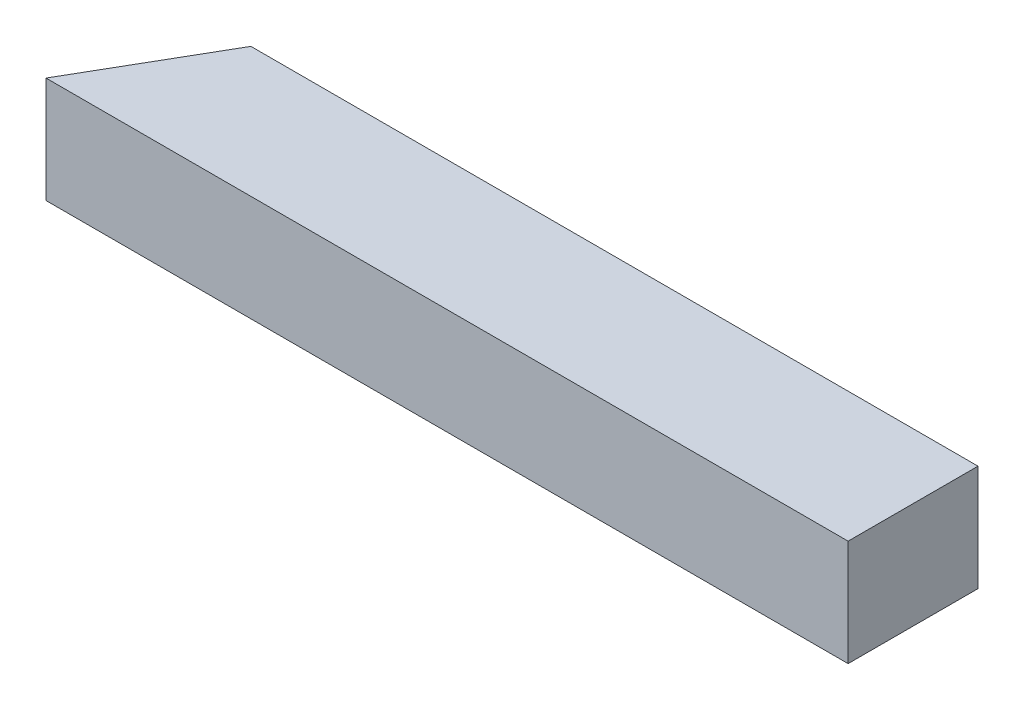
ISO-10303-21;
HEADER;
FILE_DESCRIPTION(('STEP AP214'),'2;1');
FILE_NAME('part.step','',(''),(''),'','','');
FILE_SCHEMA(('AUTOMOTIVE_DESIGN { 1 0 10303 214 1 1 1 1 }'));
ENDSEC;
DATA;
#1=APPLICATION_CONTEXT('core data for automotive mechanical design processes');
#2=APPLICATION_PROTOCOL_DEFINITION('international standard','automotive_design',2000,#1);
#3=PRODUCT_CONTEXT('',#1,'mechanical');
#4=PRODUCT('Part','Part','',(#3));
#5=PRODUCT_RELATED_PRODUCT_CATEGORY('part','',(#4));
#6=PRODUCT_DEFINITION_FORMATION('','',#4);
#7=PRODUCT_DEFINITION_CONTEXT('part definition',#1,'design');
#8=PRODUCT_DEFINITION('design','',#6,#7);
#9=PRODUCT_DEFINITION_SHAPE('','',#8);
#10=(LENGTH_UNIT() NAMED_UNIT(*) SI_UNIT(.MILLI.,.METRE.));
#11=(NAMED_UNIT(*) PLANE_ANGLE_UNIT() SI_UNIT($,.RADIAN.));
#12=(NAMED_UNIT(*) SI_UNIT($,.STERADIAN.) SOLID_ANGLE_UNIT());
#13=UNCERTAINTY_MEASURE_WITH_UNIT(LENGTH_MEASURE(1.E-05),#10,'distance_accuracy_value','');
#14=(GEOMETRIC_REPRESENTATION_CONTEXT(3) GLOBAL_UNCERTAINTY_ASSIGNED_CONTEXT((#13)) GLOBAL_UNIT_ASSIGNED_CONTEXT((#10,
#11,#12)) REPRESENTATION_CONTEXT('',''));
#15=CARTESIAN_POINT('',(0.,0.,0.));
#16=DIRECTION('',(0.,0.,1.));
#17=DIRECTION('',(1.,0.,0.));
#18=AXIS2_PLACEMENT_3D('',#15,#16,#17);
#19=CARTESIAN_POINT('',(-98.1950340780662,25.4,-56.6929293580556));
#20=DIRECTION('',(-0.86602540378444,0.,-0.499999999999998));
#21=DIRECTION('',(-0.499999999999998,0.,0.86602540378444));
#22=AXIS2_PLACEMENT_3D('',#19,#20,#21);
#23=PLANE('',#22);
#24=DIRECTION('',(0.499999999999998,0.,-0.86602540378444));
#25=VECTOR('',#24,1.);
#26=CARTESIAN_POINT('',(-98.1950340780662,0.,-56.6929293580556));
#27=LINE('',#26,#25);
#28=CARTESIAN_POINT('',(-146.809160302459,0.,27.5092072281595));
#29=VERTEX_POINT('',#28);
#30=CARTESIAN_POINT('',(-128.853566930662,0.,-3.5907927718405));
#31=VERTEX_POINT('',#30);
#32=EDGE_CURVE('E98',#29,#31,#27,.T.);
#33=ORIENTED_EDGE('',*,*,#32,.F.);
#34=DIRECTION('',(0.,-1.,0.));
#35=VECTOR('',#34,1.);
#36=CARTESIAN_POINT('',(-146.809160302459,25.4,27.5092072281595));
#37=LINE('',#36,#35);
#38=CARTESIAN_POINT('',(-146.809160302459,25.4,27.5092072281595));
#39=VERTEX_POINT('',#38);
#40=EDGE_CURVE('E11',#39,#29,#37,.T.);
#41=ORIENTED_EDGE('',*,*,#40,.F.);
#42=DIRECTION('',(0.499999999999998,0.,-0.86602540378444));
#43=VECTOR('',#42,1.);
#44=CARTESIAN_POINT('',(-98.1950340780662,25.4,-56.6929293580556));
#45=LINE('',#44,#43);
#46=CARTESIAN_POINT('',(-128.853566930662,25.4,-3.5907927718405));
#47=VERTEX_POINT('',#46);
#48=EDGE_CURVE('E83',#39,#47,#45,.T.);
#49=ORIENTED_EDGE('',*,*,#48,.T.);
#50=DIRECTION('',(0.,-1.,0.));
#51=VECTOR('',#50,1.);
#52=CARTESIAN_POINT('',(-128.853566930662,25.4,-3.5907927718405));
#53=LINE('',#52,#51);
#54=EDGE_CURVE('E51',#47,#31,#53,.T.);
#55=ORIENTED_EDGE('',*,*,#54,.T.);
#56=EDGE_LOOP('',(#33,#41,#49,#55));
#57=FACE_BOUND('',#56,.T.);
#58=ADVANCED_FACE('F35',(#57),#23,.T.);
#59=CARTESIAN_POINT('',(0.,25.4,27.5092072281595));
#60=DIRECTION('',(0.,0.,-1.));
#61=DIRECTION('',(-1.,0.,0.));
#62=AXIS2_PLACEMENT_3D('',#59,#60,#61);
#63=PLANE('',#62);
#64=DIRECTION('',(1.,0.,0.));
#65=VECTOR('',#64,1.);
#66=CARTESIAN_POINT('',(0.,0.,27.5092072281595));
#67=LINE('',#66,#65);
#68=CARTESIAN_POINT('',(45.2352463257436,0.,27.5092072281595));
#69=VERTEX_POINT('',#68);
#70=EDGE_CURVE('E89',#29,#69,#67,.T.);
#71=ORIENTED_EDGE('',*,*,#70,.T.);
#72=DIRECTION('',(0.,-1.,0.));
#73=VECTOR('',#72,1.);
#74=CARTESIAN_POINT('',(45.2352463257436,25.4,27.5092072281595));
#75=LINE('',#74,#73);
#76=CARTESIAN_POINT('',(45.2352463257436,25.4,27.5092072281595));
#77=VERTEX_POINT('',#76);
#78=EDGE_CURVE('E43',#77,#69,#75,.T.);
#79=ORIENTED_EDGE('',*,*,#78,.F.);
#80=DIRECTION('',(1.,0.,0.));
#81=VECTOR('',#80,1.);
#82=CARTESIAN_POINT('',(0.,25.4,27.5092072281595));
#83=LINE('',#82,#81);
#84=EDGE_CURVE('E77',#39,#77,#83,.T.);
#85=ORIENTED_EDGE('',*,*,#84,.F.);
#86=ORIENTED_EDGE('',*,*,#40,.T.);
#87=EDGE_LOOP('',(#71,#79,#85,#86));
#88=FACE_BOUND('',#87,.T.);
#89=ADVANCED_FACE('F87',(#88),#63,.F.);
#90=CARTESIAN_POINT('',(45.2352463257436,25.4,0.));
#91=DIRECTION('',(1.,0.,0.));
#92=DIRECTION('',(0.,0.,-1.));
#93=AXIS2_PLACEMENT_3D('',#90,#91,#92);
#94=PLANE('',#93);
#95=DIRECTION('',(0.,0.,1.));
#96=VECTOR('',#95,1.);
#97=CARTESIAN_POINT('',(45.2352463257436,0.,0.));
#98=LINE('',#97,#96);
#99=CARTESIAN_POINT('',(45.2352463257436,0.,-3.5907927718405));
#100=VERTEX_POINT('',#99);
#101=EDGE_CURVE('E101',#100,#69,#98,.T.);
#102=ORIENTED_EDGE('',*,*,#101,.F.);
#103=DIRECTION('',(0.,-1.,0.));
#104=VECTOR('',#103,1.);
#105=CARTESIAN_POINT('',(45.2352463257436,25.4,-3.5907927718405));
#106=LINE('',#105,#104);
#107=CARTESIAN_POINT('',(45.2352463257436,25.4,-3.5907927718405));
#108=VERTEX_POINT('',#107);
#109=EDGE_CURVE('E64',#108,#100,#106,.T.);
#110=ORIENTED_EDGE('',*,*,#109,.F.);
#111=DIRECTION('',(0.,0.,1.));
#112=VECTOR('',#111,1.);
#113=CARTESIAN_POINT('',(45.2352463257436,25.4,0.));
#114=LINE('',#113,#112);
#115=EDGE_CURVE('E82',#108,#77,#114,.T.);
#116=ORIENTED_EDGE('',*,*,#115,.T.);
#117=ORIENTED_EDGE('',*,*,#78,.T.);
#118=EDGE_LOOP('',(#102,#110,#116,#117));
#119=FACE_BOUND('',#118,.T.);
#120=ADVANCED_FACE('F92',(#119),#94,.T.);
#121=CARTESIAN_POINT('',(0.,25.4,-3.5907927718405));
#122=DIRECTION('',(0.,0.,-1.));
#123=DIRECTION('',(-1.,0.,0.));
#124=AXIS2_PLACEMENT_3D('',#121,#122,#123);
#125=PLANE('',#124);
#126=DIRECTION('',(1.,0.,0.));
#127=VECTOR('',#126,1.);
#128=CARTESIAN_POINT('',(0.,0.,-3.5907927718405));
#129=LINE('',#128,#127);
#130=EDGE_CURVE('E103',#31,#100,#129,.T.);
#131=ORIENTED_EDGE('',*,*,#130,.F.);
#132=ORIENTED_EDGE('',*,*,#54,.F.);
#133=DIRECTION('',(1.,0.,0.));
#134=VECTOR('',#133,1.);
#135=CARTESIAN_POINT('',(0.,25.4,-3.5907927718405));
#136=LINE('',#135,#134);
#137=EDGE_CURVE('E93',#47,#108,#136,.T.);
#138=ORIENTED_EDGE('',*,*,#137,.T.);
#139=ORIENTED_EDGE('',*,*,#109,.T.);
#140=EDGE_LOOP('',(#131,#132,#138,#139));
#141=FACE_BOUND('',#140,.T.);
#142=ADVANCED_FACE('F108',(#141),#125,.T.);
#143=CARTESIAN_POINT('',(0.,25.4,0.));
#144=DIRECTION('',(0.,1.,0.));
#145=DIRECTION('',(0.,0.,1.));
#146=AXIS2_PLACEMENT_3D('',#143,#144,#145);
#147=PLANE('',#146);
#148=ORIENTED_EDGE('',*,*,#48,.F.);
#149=ORIENTED_EDGE('',*,*,#84,.T.);
#150=ORIENTED_EDGE('',*,*,#115,.F.);
#151=ORIENTED_EDGE('',*,*,#137,.F.);
#152=EDGE_LOOP('',(#148,#149,#150,#151));
#153=FACE_BOUND('',#152,.T.);
#154=ADVANCED_FACE('F79',(#153),#147,.T.);
#155=CARTESIAN_POINT('',(0.,0.,0.));
#156=DIRECTION('',(0.,1.,0.));
#157=DIRECTION('',(0.,0.,1.));
#158=AXIS2_PLACEMENT_3D('',#155,#156,#157);
#159=PLANE('',#158);
#160=ORIENTED_EDGE('',*,*,#32,.T.);
#161=ORIENTED_EDGE('',*,*,#130,.T.);
#162=ORIENTED_EDGE('',*,*,#101,.T.);
#163=ORIENTED_EDGE('',*,*,#70,.F.);
#164=EDGE_LOOP('',(#160,#161,#162,#163));
#165=FACE_BOUND('',#164,.T.);
#166=ADVANCED_FACE('F115',(#165),#159,.F.);
#167=CLOSED_SHELL('',(#58,#89,#120,#142,#154,#166));
#168=MANIFOLD_SOLID_BREP('B2',#167);
#169=ADVANCED_BREP_SHAPE_REPRESENTATION('',(#18,#168),#14);
#170=SHAPE_DEFINITION_REPRESENTATION(#9,#169);
ENDSEC;
END-ISO-10303-21;
